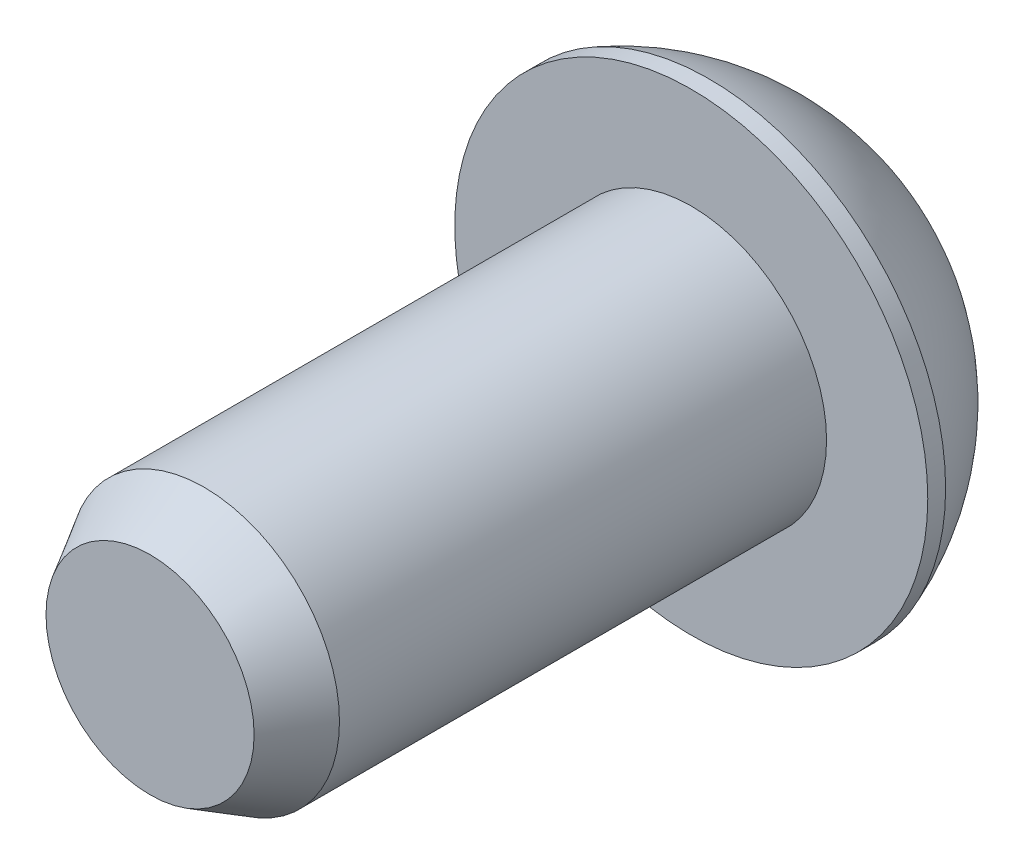
ISO-10303-21;
HEADER;
FILE_DESCRIPTION(('STEP AP214'),'2;1');
FILE_NAME('part.step','',(''),(''),'','','');
FILE_SCHEMA(('AUTOMOTIVE_DESIGN { 1 0 10303 214 1 1 1 1 }'));
ENDSEC;
DATA;
#1=APPLICATION_CONTEXT('core data for automotive mechanical design processes');
#2=APPLICATION_PROTOCOL_DEFINITION('international standard','automotive_design',2000,#1);
#3=PRODUCT_CONTEXT('',#1,'mechanical');
#4=PRODUCT('Part','Part','',(#3));
#5=PRODUCT_RELATED_PRODUCT_CATEGORY('part','',(#4));
#6=PRODUCT_DEFINITION_FORMATION('','',#4);
#7=PRODUCT_DEFINITION_CONTEXT('part definition',#1,'design');
#8=PRODUCT_DEFINITION('design','',#6,#7);
#9=PRODUCT_DEFINITION_SHAPE('','',#8);
#10=(LENGTH_UNIT() NAMED_UNIT(*) SI_UNIT(.MILLI.,.METRE.));
#11=(NAMED_UNIT(*) PLANE_ANGLE_UNIT() SI_UNIT($,.RADIAN.));
#12=(NAMED_UNIT(*) SI_UNIT($,.STERADIAN.) SOLID_ANGLE_UNIT());
#13=UNCERTAINTY_MEASURE_WITH_UNIT(LENGTH_MEASURE(1.E-05),#10,'distance_accuracy_value','');
#14=(GEOMETRIC_REPRESENTATION_CONTEXT(3) GLOBAL_UNCERTAINTY_ASSIGNED_CONTEXT((#13)) GLOBAL_UNIT_ASSIGNED_CONTEXT((#10,
#11,#12)) REPRESENTATION_CONTEXT('',''));
#15=CARTESIAN_POINT('',(0.,0.,0.));
#16=DIRECTION('',(0.,0.,1.));
#17=DIRECTION('',(1.,0.,0.));
#18=AXIS2_PLACEMENT_3D('',#15,#16,#17);
#19=CARTESIAN_POINT('',(5.54989996262454,0.,3.35279999999999));
#20=DIRECTION('',(0.,0.,1.));
#21=DIRECTION('',(1.,0.,0.));
#22=AXIS2_PLACEMENT_3D('',#19,#20,#21);
#23=PLANE('',#22);
#24=CARTESIAN_POINT('',(-1.63058039293063E-08,0.,3.35279999999999));
#25=DIRECTION('',(0.,0.,1.));
#26=DIRECTION('',(1.,0.,0.));
#27=AXIS2_PLACEMENT_3D('',#24,#25,#26);
#28=CIRCLE('',#27,5.54989997893035);
#29=CARTESIAN_POINT('',(5.54989996262455,0.,3.35279999999999));
#30=VERTEX_POINT('',#29);
#31=EDGE_CURVE('E148',#30,#30,#28,.T.);
#32=ORIENTED_EDGE('',*,*,#31,.T.);
#33=EDGE_LOOP('',(#32));
#34=FACE_BOUND('',#33,.T.);
#35=CARTESIAN_POINT('',(0.,0.,3.35279999999999));
#36=DIRECTION('',(0.,0.,1.));
#37=DIRECTION('',(1.,0.,0.));
#38=AXIS2_PLACEMENT_3D('',#35,#36,#37);
#39=CIRCLE('',#38,3.175);
#40=CARTESIAN_POINT('',(3.175,0.,3.35279999999999));
#41=VERTEX_POINT('',#40);
#42=EDGE_CURVE('E127',#41,#41,#39,.T.);
#43=ORIENTED_EDGE('',*,*,#42,.F.);
#44=EDGE_LOOP('',(#43));
#45=FACE_BOUND('',#44,.T.);
#46=ADVANCED_FACE('F37',(#34,#45),#23,.T.);
#47=CARTESIAN_POINT('',(-2.10696946001399E-08,0.,4.99835714285725));
#48=DIRECTION('',(0.,0.,1.));
#49=DIRECTION('',(1.,0.,0.));
#50=AXIS2_PLACEMENT_3D('',#47,#48,#49);
#51=SPHERICAL_SURFACE('',#50,5.92150311760007);
#52=CARTESIAN_POINT('',(-1.63058039293063E-08,0.,0.));
#53=DIRECTION('',(0.,0.,1.));
#54=DIRECTION('',(1.,0.,0.));
#55=AXIS2_PLACEMENT_3D('',#52,#53,#54);
#56=CIRCLE('',#55,3.17500000219601);
#57=CARTESIAN_POINT('',(3.1749999858902,0.,0.));
#58=VERTEX_POINT('',#57);
#59=EDGE_CURVE('E151',#58,#58,#56,.T.);
#60=ORIENTED_EDGE('',*,*,#59,.T.);
#61=EDGE_LOOP('',(#60));
#62=FACE_BOUND('',#61,.T.);
#63=CARTESIAN_POINT('',(-1.63058039293063E-08,0.,2.93369994546637));
#64=DIRECTION('',(0.,0.,1.));
#65=DIRECTION('',(1.,0.,0.));
#66=AXIS2_PLACEMENT_3D('',#63,#64,#65);
#67=CIRCLE('',#66,5.54989997893035);
#68=CARTESIAN_POINT('',(5.54989996262455,0.,2.93369994546637));
#69=VERTEX_POINT('',#68);
#70=EDGE_CURVE('E140',#69,#69,#67,.T.);
#71=ORIENTED_EDGE('',*,*,#70,.F.);
#72=EDGE_LOOP('',(#71));
#73=FACE_BOUND('',#72,.T.);
#74=ADVANCED_FACE('F167',(#62,#73),#51,.T.);
#75=CARTESIAN_POINT('',(-1.63058039293063E-08,0.,0.));
#76=DIRECTION('',(0.,0.,-1.));
#77=DIRECTION('',(-1.,0.,0.));
#78=AXIS2_PLACEMENT_3D('',#75,#76,#77);
#79=PLANE('',#78);
#80=DIRECTION('',(-0.5,0.866025403784439,0.));
#81=VECTOR('',#80,1.);
#82=CARTESIAN_POINT('',(-1.14567944042317,-1.984375,0.));
#83=LINE('',#82,#81);
#84=CARTESIAN_POINT('',(-1.14567944042317,-1.984375,0.));
#85=VERTEX_POINT('',#84);
#86=CARTESIAN_POINT('',(-2.29135888084633,0.,0.));
#87=VERTEX_POINT('',#86);
#88=EDGE_CURVE('E52',#85,#87,#83,.T.);
#89=ORIENTED_EDGE('',*,*,#88,.F.);
#90=DIRECTION('',(-1.,0.,0.));
#91=VECTOR('',#90,1.);
#92=CARTESIAN_POINT('',(1.14567944042316,-1.984375,0.));
#93=LINE('',#92,#91);
#94=CARTESIAN_POINT('',(1.14567944042316,-1.984375,0.));
#95=VERTEX_POINT('',#94);
#96=EDGE_CURVE('E136',#95,#85,#93,.T.);
#97=ORIENTED_EDGE('',*,*,#96,.F.);
#98=DIRECTION('',(-0.5,-0.866025403784438,0.));
#99=VECTOR('',#98,1.);
#100=CARTESIAN_POINT('',(2.29135888084632,0.,0.));
#101=LINE('',#100,#99);
#102=CARTESIAN_POINT('',(2.29135888084632,0.,0.));
#103=VERTEX_POINT('',#102);
#104=EDGE_CURVE('E134',#103,#95,#101,.T.);
#105=ORIENTED_EDGE('',*,*,#104,.F.);
#106=DIRECTION('',(0.5,-0.866025403784439,0.));
#107=VECTOR('',#106,1.);
#108=CARTESIAN_POINT('',(1.14567944042316,1.984375,0.));
#109=LINE('',#108,#107);
#110=CARTESIAN_POINT('',(1.14567944042316,1.984375,0.));
#111=VERTEX_POINT('',#110);
#112=EDGE_CURVE('E100',#111,#103,#109,.T.);
#113=ORIENTED_EDGE('',*,*,#112,.F.);
#114=DIRECTION('',(1.,0.,0.));
#115=VECTOR('',#114,1.);
#116=CARTESIAN_POINT('',(-1.14567944042317,1.984375,0.));
#117=LINE('',#116,#115);
#118=CARTESIAN_POINT('',(-1.14567944042317,1.984375,0.));
#119=VERTEX_POINT('',#118);
#120=EDGE_CURVE('E130',#119,#111,#117,.T.);
#121=ORIENTED_EDGE('',*,*,#120,.F.);
#122=DIRECTION('',(0.5,0.866025403784439,0.));
#123=VECTOR('',#122,1.);
#124=CARTESIAN_POINT('',(-2.29135888084633,0.,0.));
#125=LINE('',#124,#123);
#126=EDGE_CURVE('E126',#87,#119,#125,.T.);
#127=ORIENTED_EDGE('',*,*,#126,.F.);
#128=EDGE_LOOP('',(#89,#97,#105,#113,#121,#127));
#129=FACE_BOUND('',#128,.T.);
#130=ORIENTED_EDGE('',*,*,#59,.F.);
#131=EDGE_LOOP('',(#130));
#132=FACE_BOUND('',#131,.T.);
#133=ADVANCED_FACE('F173',(#129,#132),#79,.T.);
#134=CARTESIAN_POINT('',(-1.63058039293063E-08,0.,0.));
#135=DIRECTION('',(0.,0.,1.));
#136=DIRECTION('',(1.,0.,0.));
#137=AXIS2_PLACEMENT_3D('',#134,#135,#136);
#138=CYLINDRICAL_SURFACE('',#137,5.54989997893035);
#139=ORIENTED_EDGE('',*,*,#70,.T.);
#140=EDGE_LOOP('',(#139));
#141=FACE_BOUND('',#140,.T.);
#142=ORIENTED_EDGE('',*,*,#31,.F.);
#143=EDGE_LOOP('',(#142));
#144=FACE_BOUND('',#143,.T.);
#145=ADVANCED_FACE('F178',(#141,#144),#138,.T.);
#146=CARTESIAN_POINT('',(-1.14567944042317,-1.984375,2.2225));
#147=DIRECTION('',(-0.866025403784439,-0.5,0.));
#148=DIRECTION('',(0.5,-0.866025403784439,0.));
#149=AXIS2_PLACEMENT_3D('',#146,#147,#148);
#150=PLANE('',#149);
#151=ORIENTED_EDGE('',*,*,#88,.T.);
#152=DIRECTION('',(0.,0.,-1.));
#153=VECTOR('',#152,1.);
#154=CARTESIAN_POINT('',(-2.29135888084633,0.,2.2225));
#155=LINE('',#154,#153);
#156=CARTESIAN_POINT('',(-2.29135888084633,0.,2.2225));
#157=VERTEX_POINT('',#156);
#158=EDGE_CURVE('E82',#157,#87,#155,.T.);
#159=ORIENTED_EDGE('',*,*,#158,.F.);
#160=DIRECTION('',(-0.5,0.866025403784439,0.));
#161=VECTOR('',#160,1.);
#162=CARTESIAN_POINT('',(-1.14567944042317,-1.984375,2.2225));
#163=LINE('',#162,#161);
#164=CARTESIAN_POINT('',(-1.14567944042317,-1.984375,2.2225));
#165=VERTEX_POINT('',#164);
#166=EDGE_CURVE('E138',#165,#157,#163,.T.);
#167=ORIENTED_EDGE('',*,*,#166,.F.);
#168=DIRECTION('',(0.,0.,-1.));
#169=VECTOR('',#168,1.);
#170=CARTESIAN_POINT('',(-1.14567944042317,-1.984375,2.2225));
#171=LINE('',#170,#169);
#172=EDGE_CURVE('E60',#165,#85,#171,.T.);
#173=ORIENTED_EDGE('',*,*,#172,.T.);
#174=EDGE_LOOP('',(#151,#159,#167,#173));
#175=FACE_BOUND('',#174,.T.);
#176=ADVANCED_FACE('F185',(#175),#150,.F.);
#177=CARTESIAN_POINT('',(1.14567944042316,-1.984375,2.2225));
#178=DIRECTION('',(0.,-1.,0.));
#179=DIRECTION('',(1.,0.,0.));
#180=AXIS2_PLACEMENT_3D('',#177,#178,#179);
#181=PLANE('',#180);
#182=ORIENTED_EDGE('',*,*,#96,.T.);
#183=ORIENTED_EDGE('',*,*,#172,.F.);
#184=DIRECTION('',(-1.,0.,0.));
#185=VECTOR('',#184,1.);
#186=CARTESIAN_POINT('',(1.14567944042316,-1.984375,2.2225));
#187=LINE('',#186,#185);
#188=CARTESIAN_POINT('',(1.14567944042316,-1.984375,2.2225));
#189=VERTEX_POINT('',#188);
#190=EDGE_CURVE('E112',#189,#165,#187,.T.);
#191=ORIENTED_EDGE('',*,*,#190,.F.);
#192=DIRECTION('',(0.,0.,-1.));
#193=VECTOR('',#192,1.);
#194=CARTESIAN_POINT('',(1.14567944042316,-1.984375,2.2225));
#195=LINE('',#194,#193);
#196=EDGE_CURVE('E104',#189,#95,#195,.T.);
#197=ORIENTED_EDGE('',*,*,#196,.T.);
#198=EDGE_LOOP('',(#182,#183,#191,#197));
#199=FACE_BOUND('',#198,.T.);
#200=ADVANCED_FACE('F211',(#199),#181,.F.);
#201=CARTESIAN_POINT('',(2.29135888084632,0.,2.2225));
#202=DIRECTION('',(0.866025403784438,-0.5,0.));
#203=DIRECTION('',(0.5,0.866025403784439,0.));
#204=AXIS2_PLACEMENT_3D('',#201,#202,#203);
#205=PLANE('',#204);
#206=ORIENTED_EDGE('',*,*,#104,.T.);
#207=ORIENTED_EDGE('',*,*,#196,.F.);
#208=DIRECTION('',(-0.5,-0.866025403784438,0.));
#209=VECTOR('',#208,1.);
#210=CARTESIAN_POINT('',(2.29135888084632,0.,2.2225));
#211=LINE('',#210,#209);
#212=CARTESIAN_POINT('',(2.29135888084632,0.,2.2225));
#213=VERTEX_POINT('',#212);
#214=EDGE_CURVE('E108',#213,#189,#211,.T.);
#215=ORIENTED_EDGE('',*,*,#214,.F.);
#216=DIRECTION('',(0.,0.,-1.));
#217=VECTOR('',#216,1.);
#218=CARTESIAN_POINT('',(2.29135888084632,0.,2.2225));
#219=LINE('',#218,#217);
#220=EDGE_CURVE('E93',#213,#103,#219,.T.);
#221=ORIENTED_EDGE('',*,*,#220,.T.);
#222=EDGE_LOOP('',(#206,#207,#215,#221));
#223=FACE_BOUND('',#222,.T.);
#224=ADVANCED_FACE('F109',(#223),#205,.F.);
#225=CARTESIAN_POINT('',(1.14567944042316,1.984375,2.2225));
#226=DIRECTION('',(0.866025403784439,0.5,0.));
#227=DIRECTION('',(-0.5,0.866025403784439,0.));
#228=AXIS2_PLACEMENT_3D('',#225,#226,#227);
#229=PLANE('',#228);
#230=ORIENTED_EDGE('',*,*,#112,.T.);
#231=ORIENTED_EDGE('',*,*,#220,.F.);
#232=DIRECTION('',(0.5,-0.866025403784439,0.));
#233=VECTOR('',#232,1.);
#234=CARTESIAN_POINT('',(1.14567944042316,1.984375,2.2225));
#235=LINE('',#234,#233);
#236=CARTESIAN_POINT('',(1.14567944042316,1.984375,2.2225));
#237=VERTEX_POINT('',#236);
#238=EDGE_CURVE('E97',#237,#213,#235,.T.);
#239=ORIENTED_EDGE('',*,*,#238,.F.);
#240=DIRECTION('',(0.,0.,-1.));
#241=VECTOR('',#240,1.);
#242=CARTESIAN_POINT('',(1.14567944042316,1.984375,2.2225));
#243=LINE('',#242,#241);
#244=EDGE_CURVE('E105',#237,#111,#243,.T.);
#245=ORIENTED_EDGE('',*,*,#244,.T.);
#246=EDGE_LOOP('',(#230,#231,#239,#245));
#247=FACE_BOUND('',#246,.T.);
#248=ADVANCED_FACE('F95',(#247),#229,.F.);
#249=CARTESIAN_POINT('',(-1.14567944042317,1.984375,2.2225));
#250=DIRECTION('',(0.,1.,0.));
#251=DIRECTION('',(-1.,0.,0.));
#252=AXIS2_PLACEMENT_3D('',#249,#250,#251);
#253=PLANE('',#252);
#254=ORIENTED_EDGE('',*,*,#120,.T.);
#255=ORIENTED_EDGE('',*,*,#244,.F.);
#256=DIRECTION('',(1.,0.,0.));
#257=VECTOR('',#256,1.);
#258=CARTESIAN_POINT('',(-1.14567944042317,1.984375,2.2225));
#259=LINE('',#258,#257);
#260=CARTESIAN_POINT('',(-1.14567944042317,1.984375,2.2225));
#261=VERTEX_POINT('',#260);
#262=EDGE_CURVE('E118',#261,#237,#259,.T.);
#263=ORIENTED_EDGE('',*,*,#262,.F.);
#264=DIRECTION('',(0.,0.,-1.));
#265=VECTOR('',#264,1.);
#266=CARTESIAN_POINT('',(-1.14567944042317,1.984375,2.2225));
#267=LINE('',#266,#265);
#268=EDGE_CURVE('E143',#261,#119,#267,.T.);
#269=ORIENTED_EDGE('',*,*,#268,.T.);
#270=EDGE_LOOP('',(#254,#255,#263,#269));
#271=FACE_BOUND('',#270,.T.);
#272=ADVANCED_FACE('F218',(#271),#253,.F.);
#273=CARTESIAN_POINT('',(-2.29135888084633,0.,2.2225));
#274=DIRECTION('',(-0.866025403784439,0.5,0.));
#275=DIRECTION('',(-0.5,-0.866025403784439,0.));
#276=AXIS2_PLACEMENT_3D('',#273,#274,#275);
#277=PLANE('',#276);
#278=ORIENTED_EDGE('',*,*,#126,.T.);
#279=ORIENTED_EDGE('',*,*,#268,.F.);
#280=DIRECTION('',(0.5,0.866025403784439,0.));
#281=VECTOR('',#280,1.);
#282=CARTESIAN_POINT('',(-2.29135888084633,0.,2.2225));
#283=LINE('',#282,#281);
#284=EDGE_CURVE('E120',#157,#261,#283,.T.);
#285=ORIENTED_EDGE('',*,*,#284,.F.);
#286=ORIENTED_EDGE('',*,*,#158,.T.);
#287=EDGE_LOOP('',(#278,#279,#285,#286));
#288=FACE_BOUND('',#287,.T.);
#289=ADVANCED_FACE('F197',(#288),#277,.F.);
#290=CARTESIAN_POINT('',(-2.29135888084633,0.,2.2225));
#291=DIRECTION('',(0.,0.,-1.));
#292=DIRECTION('',(-1.,0.,0.));
#293=AXIS2_PLACEMENT_3D('',#290,#291,#292);
#294=PLANE('',#293);
#295=ORIENTED_EDGE('',*,*,#166,.T.);
#296=ORIENTED_EDGE('',*,*,#284,.T.);
#297=ORIENTED_EDGE('',*,*,#262,.T.);
#298=ORIENTED_EDGE('',*,*,#238,.T.);
#299=ORIENTED_EDGE('',*,*,#214,.T.);
#300=ORIENTED_EDGE('',*,*,#190,.T.);
#301=EDGE_LOOP('',(#295,#296,#297,#298,#299,#300));
#302=FACE_BOUND('',#301,.T.);
#303=ADVANCED_FACE('F115',(#302),#294,.T.);
#304=CARTESIAN_POINT('',(0.,0.,16.0528));
#305=DIRECTION('',(0.,0.,-1.));
#306=DIRECTION('',(-1.,0.,0.));
#307=AXIS2_PLACEMENT_3D('',#304,#305,#306);
#308=CYLINDRICAL_SURFACE('',#307,3.175);
#309=CARTESIAN_POINT('',(0.,0.,14.7828));
#310=DIRECTION('',(0.,0.,1.));
#311=DIRECTION('',(1.,0.,0.));
#312=AXIS2_PLACEMENT_3D('',#309,#310,#311);
#313=CIRCLE('',#312,3.175);
#314=CARTESIAN_POINT('',(3.175,0.,14.7828));
#315=VERTEX_POINT('',#314);
#316=EDGE_CURVE('E11',#315,#315,#313,.F.);
#317=ORIENTED_EDGE('',*,*,#316,.T.);
#318=EDGE_LOOP('',(#317));
#319=FACE_BOUND('',#318,.T.);
#320=ORIENTED_EDGE('',*,*,#42,.T.);
#321=EDGE_LOOP('',(#320));
#322=FACE_BOUND('',#321,.T.);
#323=ADVANCED_FACE('F163',(#319,#322),#308,.T.);
#324=CARTESIAN_POINT('',(0.,0.,16.0528));
#325=DIRECTION('',(0.,0.,1.));
#326=DIRECTION('',(1.,0.,0.));
#327=AXIS2_PLACEMENT_3D('',#324,#325,#326);
#328=PLANE('',#327);
#329=CARTESIAN_POINT('',(0.,0.,16.0528));
#330=DIRECTION('',(0.,0.,1.));
#331=DIRECTION('',(1.,0.,0.));
#332=AXIS2_PLACEMENT_3D('',#329,#330,#331);
#333=CIRCLE('',#332,2.44176515812917);
#334=CARTESIAN_POINT('',(2.44176515812917,0.,16.0528));
#335=VERTEX_POINT('',#334);
#336=EDGE_CURVE('E45',#335,#335,#333,.T.);
#337=ORIENTED_EDGE('',*,*,#336,.T.);
#338=EDGE_LOOP('',(#337));
#339=FACE_BOUND('',#338,.T.);
#340=ADVANCED_FACE('F156',(#339),#328,.T.);
#341=CARTESIAN_POINT('',(0.,0.,16.0528));
#342=DIRECTION('',(0.,0.,-1.));
#343=DIRECTION('',(-1.,0.,0.));
#344=AXIS2_PLACEMENT_3D('',#341,#342,#343);
#345=CONICAL_SURFACE('',#344,2.44176515812917,0.523598775598296);
#346=ORIENTED_EDGE('',*,*,#316,.F.);
#347=EDGE_LOOP('',(#346));
#348=FACE_BOUND('',#347,.T.);
#349=ORIENTED_EDGE('',*,*,#336,.F.);
#350=EDGE_LOOP('',(#349));
#351=FACE_BOUND('',#350,.T.);
#352=ADVANCED_FACE('F39',(#348,#351),#345,.T.);
#353=CLOSED_SHELL('',(#46,#74,#133,#145,#176,#200,#224,#248,#272,#289,#303,#323,#340,#352));
#354=MANIFOLD_SOLID_BREP('B2',#353);
#355=ADVANCED_BREP_SHAPE_REPRESENTATION('',(#18,#354),#14);
#356=SHAPE_DEFINITION_REPRESENTATION(#9,#355);
ENDSEC;
END-ISO-10303-21;
